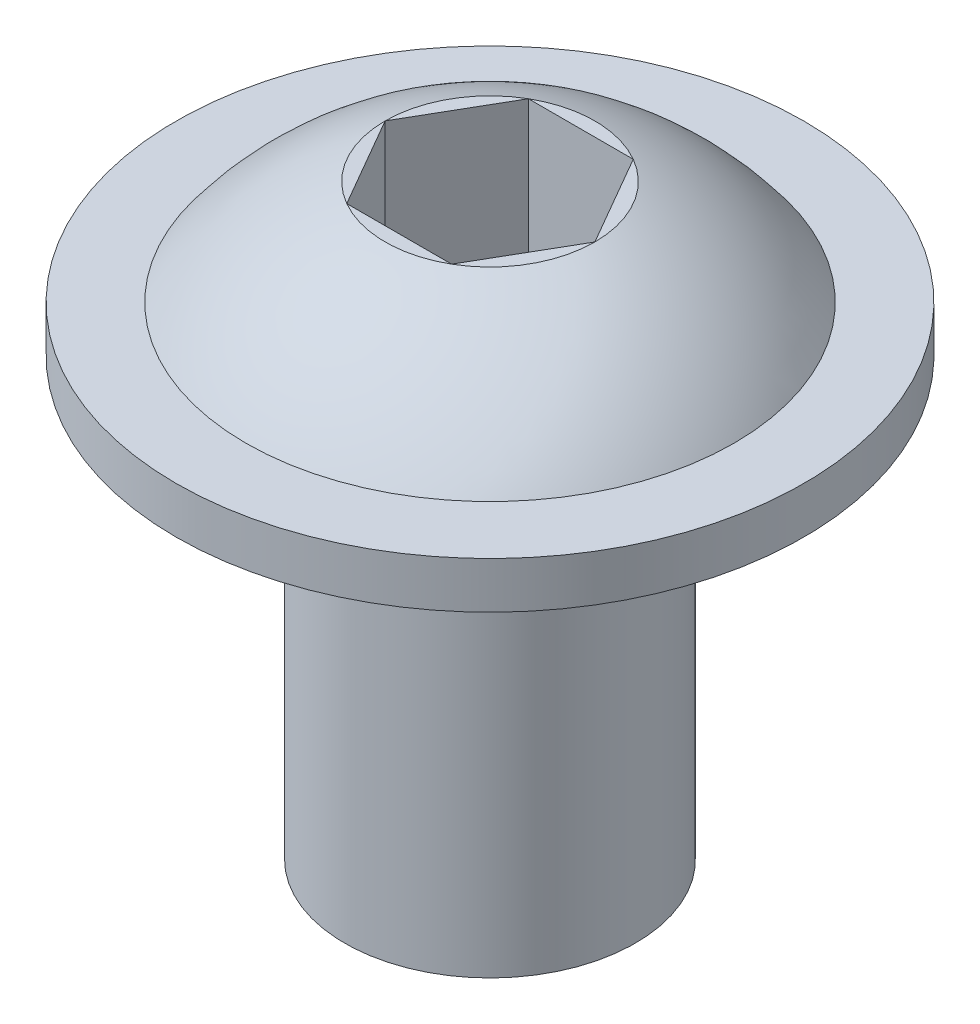
ISO-10303-21;
HEADER;
FILE_DESCRIPTION(('STEP AP214'),'2;1');
FILE_NAME('part.step','',(''),(''),'','','');
FILE_SCHEMA(('AUTOMOTIVE_DESIGN { 1 0 10303 214 1 1 1 1 }'));
ENDSEC;
DATA;
#1=APPLICATION_CONTEXT('core data for automotive mechanical design processes');
#2=APPLICATION_PROTOCOL_DEFINITION('international standard','automotive_design',2000,#1);
#3=PRODUCT_CONTEXT('',#1,'mechanical');
#4=PRODUCT('Part','Part','',(#3));
#5=PRODUCT_RELATED_PRODUCT_CATEGORY('part','',(#4));
#6=PRODUCT_DEFINITION_FORMATION('','',#4);
#7=PRODUCT_DEFINITION_CONTEXT('part definition',#1,'design');
#8=PRODUCT_DEFINITION('design','',#6,#7);
#9=PRODUCT_DEFINITION_SHAPE('','',#8);
#10=(LENGTH_UNIT() NAMED_UNIT(*) SI_UNIT(.MILLI.,.METRE.));
#11=(NAMED_UNIT(*) PLANE_ANGLE_UNIT() SI_UNIT($,.RADIAN.));
#12=(NAMED_UNIT(*) SI_UNIT($,.STERADIAN.) SOLID_ANGLE_UNIT());
#13=UNCERTAINTY_MEASURE_WITH_UNIT(LENGTH_MEASURE(1.E-05),#10,'distance_accuracy_value','');
#14=(GEOMETRIC_REPRESENTATION_CONTEXT(3) GLOBAL_UNCERTAINTY_ASSIGNED_CONTEXT((#13)) GLOBAL_UNIT_ASSIGNED_CONTEXT((#10,
#11,#12)) REPRESENTATION_CONTEXT('',''));
#15=CARTESIAN_POINT('',(0.,0.,0.));
#16=DIRECTION('',(0.,0.,1.));
#17=DIRECTION('',(1.,0.,0.));
#18=AXIS2_PLACEMENT_3D('',#15,#16,#17);
#19=CARTESIAN_POINT('',(2.29135888084633,12.827,0.));
#20=DIRECTION('',(0.,1.,0.));
#21=DIRECTION('',(0.,0.,1.));
#22=AXIS2_PLACEMENT_3D('',#19,#20,#21);
#23=PLANE('',#22);
#24=DIRECTION('',(0.5,0.,-0.866025403784439));
#25=VECTOR('',#24,1.);
#26=CARTESIAN_POINT('',(1.14567944042316,12.827,1.984375));
#27=LINE('',#26,#25);
#28=CARTESIAN_POINT('',(1.14567944042316,12.827,1.984375));
#29=VERTEX_POINT('',#28);
#30=CARTESIAN_POINT('',(2.29135888084633,12.827,0.));
#31=VERTEX_POINT('',#30);
#32=EDGE_CURVE('E48',#29,#31,#27,.T.);
#33=ORIENTED_EDGE('',*,*,#32,.F.);
#34=CARTESIAN_POINT('',(0.,12.827,0.));
#35=DIRECTION('',(0.,-1.,0.));
#36=DIRECTION('',(0.,0.,-1.));
#37=AXIS2_PLACEMENT_3D('',#34,#35,#36);
#38=CIRCLE('',#37,2.29135888084633);
#39=EDGE_CURVE('E145',#31,#29,#38,.T.);
#40=ORIENTED_EDGE('',*,*,#39,.F.);
#41=EDGE_LOOP('',(#33,#40));
#42=FACE_BOUND('',#41,.T.);
#43=ADVANCED_FACE('F33',(#42),#23,.T.);
#44=DIRECTION('',(1.,0.,0.));
#45=VECTOR('',#44,1.);
#46=CARTESIAN_POINT('',(-1.14567944042316,12.827,1.984375));
#47=LINE('',#46,#45);
#48=CARTESIAN_POINT('',(-1.14567944042316,12.827,1.984375));
#49=VERTEX_POINT('',#48);
#50=EDGE_CURVE('E131',#49,#29,#47,.T.);
#51=ORIENTED_EDGE('',*,*,#50,.F.);
#52=EDGE_CURVE('E219',#29,#49,#38,.T.);
#53=ORIENTED_EDGE('',*,*,#52,.F.);
#54=EDGE_LOOP('',(#51,#53));
#55=FACE_BOUND('',#54,.T.);
#56=ADVANCED_FACE('F172',(#55),#23,.T.);
#57=DIRECTION('',(0.5,0.,0.866025403784438));
#58=VECTOR('',#57,1.);
#59=CARTESIAN_POINT('',(-2.29135888084633,12.827,0.));
#60=LINE('',#59,#58);
#61=CARTESIAN_POINT('',(-2.29135888084633,12.827,0.));
#62=VERTEX_POINT('',#61);
#63=EDGE_CURVE('E129',#62,#49,#60,.T.);
#64=ORIENTED_EDGE('',*,*,#63,.F.);
#65=EDGE_CURVE('E220',#49,#62,#38,.T.);
#66=ORIENTED_EDGE('',*,*,#65,.F.);
#67=EDGE_LOOP('',(#64,#66));
#68=FACE_BOUND('',#67,.T.);
#69=ADVANCED_FACE('F179',(#68),#23,.T.);
#70=DIRECTION('',(-0.5,0.,0.866025403784439));
#71=VECTOR('',#70,1.);
#72=CARTESIAN_POINT('',(-1.14567944042316,12.827,-1.984375));
#73=LINE('',#72,#71);
#74=CARTESIAN_POINT('',(-1.14567944042316,12.827,-1.984375));
#75=VERTEX_POINT('',#74);
#76=EDGE_CURVE('E96',#75,#62,#73,.T.);
#77=ORIENTED_EDGE('',*,*,#76,.F.);
#78=EDGE_CURVE('E214',#62,#75,#38,.T.);
#79=ORIENTED_EDGE('',*,*,#78,.F.);
#80=EDGE_LOOP('',(#77,#79));
#81=FACE_BOUND('',#80,.T.);
#82=ADVANCED_FACE('F196',(#81),#23,.T.);
#83=DIRECTION('',(-1.,0.,0.));
#84=VECTOR('',#83,1.);
#85=CARTESIAN_POINT('',(1.14567944042316,12.827,-1.984375));
#86=LINE('',#85,#84);
#87=CARTESIAN_POINT('',(1.14567944042316,12.827,-1.984375));
#88=VERTEX_POINT('',#87);
#89=EDGE_CURVE('E125',#88,#75,#86,.T.);
#90=ORIENTED_EDGE('',*,*,#89,.F.);
#91=EDGE_CURVE('E135',#75,#88,#38,.T.);
#92=ORIENTED_EDGE('',*,*,#91,.F.);
#93=EDGE_LOOP('',(#90,#92));
#94=FACE_BOUND('',#93,.T.);
#95=ADVANCED_FACE('F187',(#94),#23,.T.);
#96=CARTESIAN_POINT('',(0.,0.,0.));
#97=DIRECTION('',(0.,-1.,0.));
#98=DIRECTION('',(0.,0.,-1.));
#99=AXIS2_PLACEMENT_3D('',#96,#97,#98);
#100=PLANE('',#99);
#101=CARTESIAN_POINT('',(0.,0.,0.));
#102=DIRECTION('',(0.,-1.,0.));
#103=DIRECTION('',(0.,0.,-1.));
#104=AXIS2_PLACEMENT_3D('',#101,#102,#103);
#105=CIRCLE('',#104,3.175);
#106=CARTESIAN_POINT('',(0.,0.,-3.175));
#107=VERTEX_POINT('',#106);
#108=EDGE_CURVE('E11',#107,#107,#105,.T.);
#109=ORIENTED_EDGE('',*,*,#108,.T.);
#110=EDGE_LOOP('',(#109));
#111=FACE_BOUND('',#110,.T.);
#112=ADVANCED_FACE('F35',(#111),#100,.T.);
#113=CARTESIAN_POINT('',(0.,0.,0.));
#114=DIRECTION('',(0.,-1.,0.));
#115=DIRECTION('',(0.,0.,-1.));
#116=AXIS2_PLACEMENT_3D('',#113,#114,#115);
#117=CYLINDRICAL_SURFACE('',#116,3.175);
#118=CARTESIAN_POINT('',(0.,9.525,0.));
#119=DIRECTION('',(0.,-1.,0.));
#120=DIRECTION('',(0.,0.,-1.));
#121=AXIS2_PLACEMENT_3D('',#118,#119,#120);
#122=CIRCLE('',#121,3.175);
#123=CARTESIAN_POINT('',(0.,9.525,-3.175));
#124=VERTEX_POINT('',#123);
#125=EDGE_CURVE('E41',#124,#124,#122,.T.);
#126=ORIENTED_EDGE('',*,*,#125,.T.);
#127=EDGE_LOOP('',(#126));
#128=FACE_BOUND('',#127,.T.);
#129=ORIENTED_EDGE('',*,*,#108,.F.);
#130=EDGE_LOOP('',(#129));
#131=FACE_BOUND('',#130,.T.);
#132=ADVANCED_FACE('F156',(#128,#131),#117,.T.);
#133=CARTESIAN_POINT('',(3.175,9.525,0.));
#134=DIRECTION('',(0.,-1.,0.));
#135=DIRECTION('',(0.,0.,-1.));
#136=AXIS2_PLACEMENT_3D('',#133,#134,#135);
#137=PLANE('',#136);
#138=CARTESIAN_POINT('',(0.,9.525,0.));
#139=DIRECTION('',(0.,-1.,0.));
#140=DIRECTION('',(0.,0.,-1.));
#141=AXIS2_PLACEMENT_3D('',#138,#139,#140);
#142=CIRCLE('',#141,6.858);
#143=CARTESIAN_POINT('',(0.,9.525,-6.858));
#144=VERTEX_POINT('',#143);
#145=EDGE_CURVE('E151',#144,#144,#142,.T.);
#146=ORIENTED_EDGE('',*,*,#145,.T.);
#147=EDGE_LOOP('',(#146));
#148=FACE_BOUND('',#147,.T.);
#149=ORIENTED_EDGE('',*,*,#125,.F.);
#150=EDGE_LOOP('',(#149));
#151=FACE_BOUND('',#150,.T.);
#152=ADVANCED_FACE('F159',(#148,#151),#137,.T.);
#153=CARTESIAN_POINT('',(0.,0.,0.));
#154=DIRECTION('',(0.,-1.,0.));
#155=DIRECTION('',(0.,0.,-1.));
#156=AXIS2_PLACEMENT_3D('',#153,#154,#155);
#157=CYLINDRICAL_SURFACE('',#156,6.858);
#158=CARTESIAN_POINT('',(0.,10.541,0.));
#159=DIRECTION('',(0.,-1.,0.));
#160=DIRECTION('',(0.,0.,-1.));
#161=AXIS2_PLACEMENT_3D('',#158,#159,#160);
#162=CIRCLE('',#161,6.858);
#163=CARTESIAN_POINT('',(0.,10.541,-6.858));
#164=VERTEX_POINT('',#163);
#165=EDGE_CURVE('E148',#164,#164,#162,.T.);
#166=ORIENTED_EDGE('',*,*,#165,.T.);
#167=EDGE_LOOP('',(#166));
#168=FACE_BOUND('',#167,.T.);
#169=ORIENTED_EDGE('',*,*,#145,.F.);
#170=EDGE_LOOP('',(#169));
#171=FACE_BOUND('',#170,.T.);
#172=ADVANCED_FACE('F161',(#168,#171),#157,.T.);
#173=CARTESIAN_POINT('',(6.858,10.541,0.));
#174=DIRECTION('',(0.,1.,0.));
#175=DIRECTION('',(0.,0.,1.));
#176=AXIS2_PLACEMENT_3D('',#173,#174,#175);
#177=PLANE('',#176);
#178=CARTESIAN_POINT('',(0.,10.541,0.));
#179=DIRECTION('',(0.,-1.,0.));
#180=DIRECTION('',(0.,0.,-1.));
#181=AXIS2_PLACEMENT_3D('',#178,#179,#180);
#182=CIRCLE('',#181,5.334);
#183=CARTESIAN_POINT('',(0.,10.541,-5.334));
#184=VERTEX_POINT('',#183);
#185=EDGE_CURVE('E144',#184,#184,#182,.T.);
#186=ORIENTED_EDGE('',*,*,#185,.T.);
#187=EDGE_LOOP('',(#186));
#188=FACE_BOUND('',#187,.T.);
#189=ORIENTED_EDGE('',*,*,#165,.F.);
#190=EDGE_LOOP('',(#189));
#191=FACE_BOUND('',#190,.T.);
#192=ADVANCED_FACE('F168',(#188,#191),#177,.T.);
#193=CARTESIAN_POINT('',(0.,6.60936516203704,0.));
#194=DIRECTION('',(0.,-1.,0.));
#195=DIRECTION('',(1.,0.,0.));
#196=AXIS2_PLACEMENT_3D('',#193,#194,#195);
#197=SPHERICAL_SURFACE('',#196,6.62640992537317);
#198=EDGE_CURVE('E141',#88,#31,#38,.T.);
#199=ORIENTED_EDGE('',*,*,#198,.T.);
#200=ORIENTED_EDGE('',*,*,#39,.T.);
#201=ORIENTED_EDGE('',*,*,#52,.T.);
#202=ORIENTED_EDGE('',*,*,#65,.T.);
#203=ORIENTED_EDGE('',*,*,#78,.T.);
#204=ORIENTED_EDGE('',*,*,#91,.T.);
#205=EDGE_LOOP('',(#199,#200,#201,#202,#203,#204));
#206=FACE_BOUND('',#205,.T.);
#207=ORIENTED_EDGE('',*,*,#185,.F.);
#208=EDGE_LOOP('',(#207));
#209=FACE_BOUND('',#208,.T.);
#210=ADVANCED_FACE('F185',(#206,#209),#197,.T.);
#211=DIRECTION('',(-0.5,0.,-0.866025403784438));
#212=VECTOR('',#211,1.);
#213=CARTESIAN_POINT('',(2.29135888084633,12.827,0.));
#214=LINE('',#213,#212);
#215=EDGE_CURVE('E122',#31,#88,#214,.T.);
#216=ORIENTED_EDGE('',*,*,#215,.F.);
#217=ORIENTED_EDGE('',*,*,#198,.F.);
#218=EDGE_LOOP('',(#216,#217));
#219=FACE_BOUND('',#218,.T.);
#220=ADVANCED_FACE('F175',(#219),#23,.T.);
#221=CARTESIAN_POINT('',(1.14567944042316,9.652,1.984375));
#222=DIRECTION('',(0.866025403784439,0.,0.5));
#223=DIRECTION('',(0.5,0.,-0.866025403784439));
#224=AXIS2_PLACEMENT_3D('',#221,#222,#223);
#225=PLANE('',#224);
#226=ORIENTED_EDGE('',*,*,#32,.T.);
#227=DIRECTION('',(0.,1.,0.));
#228=VECTOR('',#227,1.);
#229=CARTESIAN_POINT('',(2.29135888084633,9.652,0.));
#230=LINE('',#229,#228);
#231=CARTESIAN_POINT('',(2.29135888084633,9.652,0.));
#232=VERTEX_POINT('',#231);
#233=EDGE_CURVE('E78',#232,#31,#230,.T.);
#234=ORIENTED_EDGE('',*,*,#233,.F.);
#235=DIRECTION('',(0.5,0.,-0.866025403784439));
#236=VECTOR('',#235,1.);
#237=CARTESIAN_POINT('',(1.14567944042316,9.652,1.984375));
#238=LINE('',#237,#236);
#239=CARTESIAN_POINT('',(1.14567944042316,9.652,1.984375));
#240=VERTEX_POINT('',#239);
#241=EDGE_CURVE('E133',#240,#232,#238,.T.);
#242=ORIENTED_EDGE('',*,*,#241,.F.);
#243=DIRECTION('',(0.,1.,0.));
#244=VECTOR('',#243,1.);
#245=CARTESIAN_POINT('',(1.14567944042316,9.652,1.984375));
#246=LINE('',#245,#244);
#247=EDGE_CURVE('E56',#240,#29,#246,.T.);
#248=ORIENTED_EDGE('',*,*,#247,.T.);
#249=EDGE_LOOP('',(#226,#234,#242,#248));
#250=FACE_BOUND('',#249,.T.);
#251=ADVANCED_FACE('F184',(#250),#225,.F.);
#252=CARTESIAN_POINT('',(-1.14567944042316,9.652,1.984375));
#253=DIRECTION('',(0.,0.,1.));
#254=DIRECTION('',(1.,0.,0.));
#255=AXIS2_PLACEMENT_3D('',#252,#253,#254);
#256=PLANE('',#255);
#257=ORIENTED_EDGE('',*,*,#50,.T.);
#258=ORIENTED_EDGE('',*,*,#247,.F.);
#259=DIRECTION('',(1.,0.,0.));
#260=VECTOR('',#259,1.);
#261=CARTESIAN_POINT('',(-1.14567944042316,9.652,1.984375));
#262=LINE('',#261,#260);
#263=CARTESIAN_POINT('',(-1.14567944042316,9.652,1.984375));
#264=VERTEX_POINT('',#263);
#265=EDGE_CURVE('E108',#264,#240,#262,.T.);
#266=ORIENTED_EDGE('',*,*,#265,.F.);
#267=DIRECTION('',(0.,1.,0.));
#268=VECTOR('',#267,1.);
#269=CARTESIAN_POINT('',(-1.14567944042316,9.652,1.984375));
#270=LINE('',#269,#268);
#271=EDGE_CURVE('E100',#264,#49,#270,.T.);
#272=ORIENTED_EDGE('',*,*,#271,.T.);
#273=EDGE_LOOP('',(#257,#258,#266,#272));
#274=FACE_BOUND('',#273,.T.);
#275=ADVANCED_FACE('F192',(#274),#256,.F.);
#276=CARTESIAN_POINT('',(-2.29135888084633,9.652,0.));
#277=DIRECTION('',(-0.866025403784438,0.,0.5));
#278=DIRECTION('',(0.5,0.,0.866025403784439));
#279=AXIS2_PLACEMENT_3D('',#276,#277,#278);
#280=PLANE('',#279);
#281=ORIENTED_EDGE('',*,*,#63,.T.);
#282=ORIENTED_EDGE('',*,*,#271,.F.);
#283=DIRECTION('',(0.5,0.,0.866025403784438));
#284=VECTOR('',#283,1.);
#285=CARTESIAN_POINT('',(-2.29135888084633,9.652,0.));
#286=LINE('',#285,#284);
#287=CARTESIAN_POINT('',(-2.29135888084633,9.652,0.));
#288=VERTEX_POINT('',#287);
#289=EDGE_CURVE('E104',#288,#264,#286,.T.);
#290=ORIENTED_EDGE('',*,*,#289,.F.);
#291=DIRECTION('',(0.,1.,0.));
#292=VECTOR('',#291,1.);
#293=CARTESIAN_POINT('',(-2.29135888084633,9.652,0.));
#294=LINE('',#293,#292);
#295=EDGE_CURVE('E89',#288,#62,#294,.T.);
#296=ORIENTED_EDGE('',*,*,#295,.T.);
#297=EDGE_LOOP('',(#281,#282,#290,#296));
#298=FACE_BOUND('',#297,.T.);
#299=ADVANCED_FACE('F105',(#298),#280,.F.);
#300=CARTESIAN_POINT('',(-1.14567944042316,9.652,-1.984375));
#301=DIRECTION('',(-0.866025403784439,0.,-0.5));
#302=DIRECTION('',(-0.5,0.,0.866025403784439));
#303=AXIS2_PLACEMENT_3D('',#300,#301,#302);
#304=PLANE('',#303);
#305=ORIENTED_EDGE('',*,*,#76,.T.);
#306=ORIENTED_EDGE('',*,*,#295,.F.);
#307=DIRECTION('',(-0.5,0.,0.866025403784439));
#308=VECTOR('',#307,1.);
#309=CARTESIAN_POINT('',(-1.14567944042316,9.652,-1.984375));
#310=LINE('',#309,#308);
#311=CARTESIAN_POINT('',(-1.14567944042316,9.652,-1.984375));
#312=VERTEX_POINT('',#311);
#313=EDGE_CURVE('E93',#312,#288,#310,.T.);
#314=ORIENTED_EDGE('',*,*,#313,.F.);
#315=DIRECTION('',(0.,1.,0.));
#316=VECTOR('',#315,1.);
#317=CARTESIAN_POINT('',(-1.14567944042316,9.652,-1.984375));
#318=LINE('',#317,#316);
#319=EDGE_CURVE('E101',#312,#75,#318,.T.);
#320=ORIENTED_EDGE('',*,*,#319,.T.);
#321=EDGE_LOOP('',(#305,#306,#314,#320));
#322=FACE_BOUND('',#321,.T.);
#323=ADVANCED_FACE('F91',(#322),#304,.F.);
#324=CARTESIAN_POINT('',(1.14567944042316,9.652,-1.984375));
#325=DIRECTION('',(0.,0.,-1.));
#326=DIRECTION('',(-1.,0.,0.));
#327=AXIS2_PLACEMENT_3D('',#324,#325,#326);
#328=PLANE('',#327);
#329=ORIENTED_EDGE('',*,*,#89,.T.);
#330=ORIENTED_EDGE('',*,*,#319,.F.);
#331=DIRECTION('',(-1.,0.,0.));
#332=VECTOR('',#331,1.);
#333=CARTESIAN_POINT('',(1.14567944042316,9.652,-1.984375));
#334=LINE('',#333,#332);
#335=CARTESIAN_POINT('',(1.14567944042316,9.652,-1.984375));
#336=VERTEX_POINT('',#335);
#337=EDGE_CURVE('E114',#336,#312,#334,.T.);
#338=ORIENTED_EDGE('',*,*,#337,.F.);
#339=DIRECTION('',(0.,1.,0.));
#340=VECTOR('',#339,1.);
#341=CARTESIAN_POINT('',(1.14567944042316,9.652,-1.984375));
#342=LINE('',#341,#340);
#343=EDGE_CURVE('E138',#336,#88,#342,.T.);
#344=ORIENTED_EDGE('',*,*,#343,.T.);
#345=EDGE_LOOP('',(#329,#330,#338,#344));
#346=FACE_BOUND('',#345,.T.);
#347=ADVANCED_FACE('F226',(#346),#328,.F.);
#348=CARTESIAN_POINT('',(2.29135888084633,9.652,0.));
#349=DIRECTION('',(0.866025403784439,0.,-0.5));
#350=DIRECTION('',(-0.5,0.,-0.866025403784439));
#351=AXIS2_PLACEMENT_3D('',#348,#349,#350);
#352=PLANE('',#351);
#353=ORIENTED_EDGE('',*,*,#215,.T.);
#354=ORIENTED_EDGE('',*,*,#343,.F.);
#355=DIRECTION('',(-0.5,0.,-0.866025403784438));
#356=VECTOR('',#355,1.);
#357=CARTESIAN_POINT('',(2.29135888084633,9.652,0.));
#358=LINE('',#357,#356);
#359=EDGE_CURVE('E116',#232,#336,#358,.T.);
#360=ORIENTED_EDGE('',*,*,#359,.F.);
#361=ORIENTED_EDGE('',*,*,#233,.T.);
#362=EDGE_LOOP('',(#353,#354,#360,#361));
#363=FACE_BOUND('',#362,.T.);
#364=ADVANCED_FACE('F225',(#363),#352,.F.);
#365=CARTESIAN_POINT('',(3.43703832126949,9.652,-1.984375));
#366=DIRECTION('',(0.,1.,0.));
#367=DIRECTION('',(0.,0.,1.));
#368=AXIS2_PLACEMENT_3D('',#365,#366,#367);
#369=PLANE('',#368);
#370=ORIENTED_EDGE('',*,*,#241,.T.);
#371=ORIENTED_EDGE('',*,*,#359,.T.);
#372=ORIENTED_EDGE('',*,*,#337,.T.);
#373=ORIENTED_EDGE('',*,*,#313,.T.);
#374=ORIENTED_EDGE('',*,*,#289,.T.);
#375=ORIENTED_EDGE('',*,*,#265,.T.);
#376=EDGE_LOOP('',(#370,#371,#372,#373,#374,#375));
#377=FACE_BOUND('',#376,.T.);
#378=ADVANCED_FACE('F111',(#377),#369,.T.);
#379=CLOSED_SHELL('',(#43,#56,#69,#82,#95,#112,#132,#152,#172,#192,#210,#220,#251,#275,#299,
#323,#347,#364,#378));
#380=MANIFOLD_SOLID_BREP('B2',#379);
#381=ADVANCED_BREP_SHAPE_REPRESENTATION('',(#18,#380),#14);
#382=SHAPE_DEFINITION_REPRESENTATION(#9,#381);
ENDSEC;
END-ISO-10303-21;
